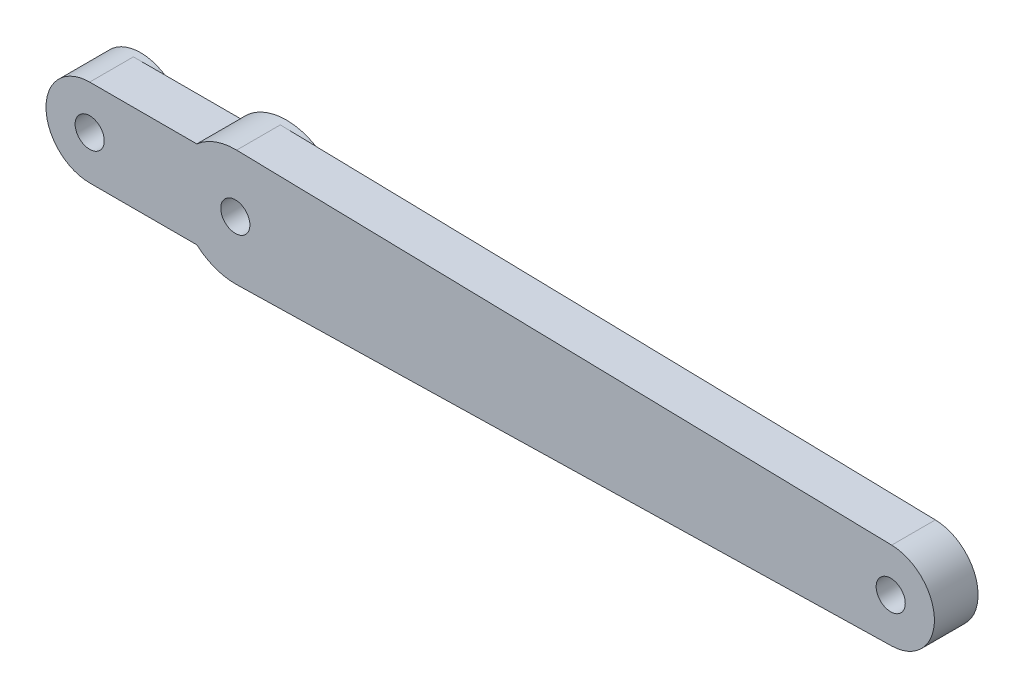
ISO-10303-21;
HEADER;
FILE_DESCRIPTION(('STEP AP214'),'2;1');
FILE_NAME('part.step','',(''),(''),'','','');
FILE_SCHEMA(('AUTOMOTIVE_DESIGN { 1 0 10303 214 1 1 1 1 }'));
ENDSEC;
DATA;
#1=APPLICATION_CONTEXT('core data for automotive mechanical design processes');
#2=APPLICATION_PROTOCOL_DEFINITION('international standard','automotive_design',2000,#1);
#3=PRODUCT_CONTEXT('',#1,'mechanical');
#4=PRODUCT('Part','Part','',(#3));
#5=PRODUCT_RELATED_PRODUCT_CATEGORY('part','',(#4));
#6=PRODUCT_DEFINITION_FORMATION('','',#4);
#7=PRODUCT_DEFINITION_CONTEXT('part definition',#1,'design');
#8=PRODUCT_DEFINITION('design','',#6,#7);
#9=PRODUCT_DEFINITION_SHAPE('','',#8);
#10=(LENGTH_UNIT() NAMED_UNIT(*) SI_UNIT(.MILLI.,.METRE.));
#11=(NAMED_UNIT(*) PLANE_ANGLE_UNIT() SI_UNIT($,.RADIAN.));
#12=(NAMED_UNIT(*) SI_UNIT($,.STERADIAN.) SOLID_ANGLE_UNIT());
#13=UNCERTAINTY_MEASURE_WITH_UNIT(LENGTH_MEASURE(1.E-05),#10,'distance_accuracy_value','');
#14=(GEOMETRIC_REPRESENTATION_CONTEXT(3) GLOBAL_UNCERTAINTY_ASSIGNED_CONTEXT((#13)) GLOBAL_UNIT_ASSIGNED_CONTEXT((#10,
#11,#12)) REPRESENTATION_CONTEXT('',''));
#15=CARTESIAN_POINT('',(0.,0.,0.));
#16=DIRECTION('',(0.,0.,1.));
#17=DIRECTION('',(1.,0.,0.));
#18=AXIS2_PLACEMENT_3D('',#15,#16,#17);
#19=CARTESIAN_POINT('',(0.,0.,0.));
#20=DIRECTION('',(0.,0.,1.));
#21=DIRECTION('',(1.,0.,0.));
#22=AXIS2_PLACEMENT_3D('',#19,#20,#21);
#23=PLANE('',#22);
#24=CARTESIAN_POINT('',(0.,0.,0.));
#25=DIRECTION('',(0.,0.,-1.));
#26=DIRECTION('',(-1.,0.,0.));
#27=AXIS2_PLACEMENT_3D('',#24,#25,#26);
#28=CIRCLE('',#27,4.);
#29=CARTESIAN_POINT('',(-2.64575131106459,-3.,0.));
#30=VERTEX_POINT('',#29);
#31=CARTESIAN_POINT('',(-2.64575131106459,3.,0.));
#32=VERTEX_POINT('',#31);
#33=EDGE_CURVE('E178',#30,#32,#28,.T.);
#34=ORIENTED_EDGE('',*,*,#33,.F.);
#35=DIRECTION('',(-1.,0.,0.));
#36=VECTOR('',#35,1.);
#37=CARTESIAN_POINT('',(0.,-3.,0.));
#38=LINE('',#37,#36);
#39=CARTESIAN_POINT('',(-10.,-3.,0.));
#40=VERTEX_POINT('',#39);
#41=EDGE_CURVE('E140',#30,#40,#38,.T.);
#42=ORIENTED_EDGE('',*,*,#41,.T.);
#43=CARTESIAN_POINT('',(-10.,0.,0.));
#44=DIRECTION('',(0.,0.,-1.));
#45=DIRECTION('',(-1.,0.,0.));
#46=AXIS2_PLACEMENT_3D('',#43,#44,#45);
#47=CIRCLE('',#46,3.);
#48=CARTESIAN_POINT('',(-10.,3.,0.));
#49=VERTEX_POINT('',#48);
#50=EDGE_CURVE('E169',#49,#40,#47,.T.);
#51=ORIENTED_EDGE('',*,*,#50,.F.);
#52=DIRECTION('',(-1.,0.,0.));
#53=VECTOR('',#52,1.);
#54=CARTESIAN_POINT('',(0.,3.,0.));
#55=LINE('',#54,#53);
#56=EDGE_CURVE('E137',#32,#49,#55,.T.);
#57=ORIENTED_EDGE('',*,*,#56,.F.);
#58=EDGE_LOOP('',(#34,#42,#51,#57));
#59=FACE_BOUND('',#58,.T.);
#60=ADVANCED_FACE('F39',(#59),#23,.F.);
#61=CARTESIAN_POINT('',(45.,0.,0.));
#62=DIRECTION('',(0.,0.,1.));
#63=DIRECTION('',(1.,0.,0.));
#64=AXIS2_PLACEMENT_3D('',#61,#62,#63);
#65=CIRCLE('',#64,0.999999999999998);
#66=CARTESIAN_POINT('',(46.,0.,0.));
#67=VERTEX_POINT('',#66);
#68=EDGE_CURVE('E150',#67,#67,#65,.T.);
#69=ORIENTED_EDGE('',*,*,#68,.T.);
#70=EDGE_LOOP('',(#69));
#71=FACE_BOUND('',#70,.T.);
#72=CARTESIAN_POINT('',(0.0888888888888888,3.99901222371626,0.));
#73=VERTEX_POINT('',#72);
#74=CARTESIAN_POINT('',(0.0888888888888888,-3.99901222371626,0.));
#75=VERTEX_POINT('',#74);
#76=EDGE_CURVE('E185',#73,#75,#28,.T.);
#77=ORIENTED_EDGE('',*,*,#76,.F.);
#78=DIRECTION('',(0.999753055929066,-0.0222222222222222,0.));
#79=VECTOR('',#78,1.);
#80=CARTESIAN_POINT('',(0.0888888888888888,3.99901222371626,0.));
#81=LINE('',#80,#79);
#82=CARTESIAN_POINT('',(45.0666666666667,2.9992591677872,0.));
#83=VERTEX_POINT('',#82);
#84=EDGE_CURVE('E147',#73,#83,#81,.T.);
#85=ORIENTED_EDGE('',*,*,#84,.T.);
#86=CARTESIAN_POINT('',(45.,0.,0.));
#87=DIRECTION('',(0.,0.,1.));
#88=DIRECTION('',(1.,0.,0.));
#89=AXIS2_PLACEMENT_3D('',#86,#87,#88);
#90=CIRCLE('',#89,3.);
#91=CARTESIAN_POINT('',(45.0666666666667,-2.9992591677872,0.));
#92=VERTEX_POINT('',#91);
#93=EDGE_CURVE('E145',#92,#83,#90,.T.);
#94=ORIENTED_EDGE('',*,*,#93,.F.);
#95=DIRECTION('',(0.999753055929066,0.0222222222222222,0.));
#96=VECTOR('',#95,1.);
#97=CARTESIAN_POINT('',(0.0888888888888889,-3.99901222371626,0.));
#98=LINE('',#97,#96);
#99=EDGE_CURVE('E75',#75,#92,#98,.T.);
#100=ORIENTED_EDGE('',*,*,#99,.F.);
#101=EDGE_LOOP('',(#77,#85,#94,#100));
#102=FACE_BOUND('',#101,.T.);
#103=ADVANCED_FACE('F186',(#71,#102),#23,.F.);
#104=CARTESIAN_POINT('',(0.,3.,3.));
#105=DIRECTION('',(0.,-1.,0.));
#106=DIRECTION('',(1.,0.,0.));
#107=AXIS2_PLACEMENT_3D('',#104,#105,#106);
#108=PLANE('',#107);
#109=ORIENTED_EDGE('',*,*,#56,.T.);
#110=DIRECTION('',(0.,0.,-1.));
#111=VECTOR('',#110,1.);
#112=CARTESIAN_POINT('',(-10.,3.,3.));
#113=LINE('',#112,#111);
#114=CARTESIAN_POINT('',(-10.,3.,3.));
#115=VERTEX_POINT('',#114);
#116=EDGE_CURVE('E48',#115,#49,#113,.T.);
#117=ORIENTED_EDGE('',*,*,#116,.F.);
#118=DIRECTION('',(-1.,0.,0.));
#119=VECTOR('',#118,1.);
#120=CARTESIAN_POINT('',(0.,3.,3.));
#121=LINE('',#120,#119);
#122=CARTESIAN_POINT('',(-2.64575131106459,3.,3.));
#123=VERTEX_POINT('',#122);
#124=EDGE_CURVE('E88',#123,#115,#121,.T.);
#125=ORIENTED_EDGE('',*,*,#124,.F.);
#126=DIRECTION('',(0.,0.,-1.));
#127=VECTOR('',#126,1.);
#128=CARTESIAN_POINT('',(-2.64575131106459,3.,3.));
#129=LINE('',#128,#127);
#130=EDGE_CURVE('E11',#123,#32,#129,.T.);
#131=ORIENTED_EDGE('',*,*,#130,.T.);
#132=EDGE_LOOP('',(#109,#117,#125,#131));
#133=FACE_BOUND('',#132,.T.);
#134=ADVANCED_FACE('F41',(#133),#108,.F.);
#135=CARTESIAN_POINT('',(-10.,0.,3.));
#136=DIRECTION('',(0.,0.,-1.));
#137=DIRECTION('',(-1.,0.,0.));
#138=AXIS2_PLACEMENT_3D('',#135,#136,#137);
#139=CYLINDRICAL_SURFACE('',#138,3.);
#140=ORIENTED_EDGE('',*,*,#116,.T.);
#141=ORIENTED_EDGE('',*,*,#50,.T.);
#142=DIRECTION('',(0.,0.,-1.));
#143=VECTOR('',#142,1.);
#144=CARTESIAN_POINT('',(-10.,-3.,3.));
#145=LINE('',#144,#143);
#146=CARTESIAN_POINT('',(-10.,-3.,3.));
#147=VERTEX_POINT('',#146);
#148=EDGE_CURVE('E160',#147,#40,#145,.T.);
#149=ORIENTED_EDGE('',*,*,#148,.F.);
#150=CARTESIAN_POINT('',(-10.,0.,3.));
#151=DIRECTION('',(0.,0.,1.));
#152=DIRECTION('',(1.,0.,0.));
#153=AXIS2_PLACEMENT_3D('',#150,#151,#152);
#154=CIRCLE('',#153,3.);
#155=EDGE_CURVE('E170',#115,#147,#154,.T.);
#156=ORIENTED_EDGE('',*,*,#155,.F.);
#157=EDGE_LOOP('',(#140,#141,#149,#156));
#158=FACE_BOUND('',#157,.T.);
#159=CARTESIAN_POINT('',(-10.,0.,-0.5));
#160=DIRECTION('',(0.,0.,-1.));
#161=DIRECTION('',(-1.,0.,0.));
#162=AXIS2_PLACEMENT_3D('',#159,#160,#161);
#163=CIRCLE('',#162,3.);
#164=CARTESIAN_POINT('',(-13.,0.,-0.5));
#165=VERTEX_POINT('',#164);
#166=EDGE_CURVE('E141',#165,#165,#163,.T.);
#167=ORIENTED_EDGE('',*,*,#166,.F.);
#168=EDGE_LOOP('',(#167));
#169=FACE_BOUND('',#168,.T.);
#170=ADVANCED_FACE('F165',(#158,#169),#139,.T.);
#171=CARTESIAN_POINT('',(0.,-3.,3.));
#172=DIRECTION('',(0.,-1.,0.));
#173=DIRECTION('',(1.,0.,0.));
#174=AXIS2_PLACEMENT_3D('',#171,#172,#173);
#175=PLANE('',#174);
#176=ORIENTED_EDGE('',*,*,#41,.F.);
#177=DIRECTION('',(0.,0.,-1.));
#178=VECTOR('',#177,1.);
#179=CARTESIAN_POINT('',(-2.64575131106459,-3.,3.));
#180=LINE('',#179,#178);
#181=CARTESIAN_POINT('',(-2.64575131106459,-3.,3.));
#182=VERTEX_POINT('',#181);
#183=EDGE_CURVE('E157',#182,#30,#180,.T.);
#184=ORIENTED_EDGE('',*,*,#183,.F.);
#185=DIRECTION('',(-1.,0.,0.));
#186=VECTOR('',#185,1.);
#187=CARTESIAN_POINT('',(0.,-3.,3.));
#188=LINE('',#187,#186);
#189=EDGE_CURVE('E237',#182,#147,#188,.T.);
#190=ORIENTED_EDGE('',*,*,#189,.T.);
#191=ORIENTED_EDGE('',*,*,#148,.T.);
#192=EDGE_LOOP('',(#176,#184,#190,#191));
#193=FACE_BOUND('',#192,.T.);
#194=ADVANCED_FACE('F241',(#193),#175,.T.);
#195=CARTESIAN_POINT('',(0.,0.,3.));
#196=DIRECTION('',(0.,0.,-1.));
#197=DIRECTION('',(-1.,0.,0.));
#198=AXIS2_PLACEMENT_3D('',#195,#196,#197);
#199=CYLINDRICAL_SURFACE('',#198,4.);
#200=ORIENTED_EDGE('',*,*,#183,.T.);
#201=ORIENTED_EDGE('',*,*,#33,.T.);
#202=ORIENTED_EDGE('',*,*,#130,.F.);
#203=CARTESIAN_POINT('',(0.,0.,3.));
#204=DIRECTION('',(0.,0.,1.));
#205=DIRECTION('',(1.,0.,0.));
#206=AXIS2_PLACEMENT_3D('',#203,#204,#205);
#207=CIRCLE('',#206,4.);
#208=CARTESIAN_POINT('',(0.0888888888888889,3.99901222371626,3.));
#209=VERTEX_POINT('',#208);
#210=EDGE_CURVE('E153',#209,#123,#207,.T.);
#211=ORIENTED_EDGE('',*,*,#210,.F.);
#212=DIRECTION('',(0.,0.,-1.));
#213=VECTOR('',#212,1.);
#214=CARTESIAN_POINT('',(0.0888888888888889,3.99901222371626,3.));
#215=LINE('',#214,#213);
#216=EDGE_CURVE('E56',#209,#73,#215,.T.);
#217=ORIENTED_EDGE('',*,*,#216,.T.);
#218=ORIENTED_EDGE('',*,*,#76,.T.);
#219=DIRECTION('',(0.,0.,-1.));
#220=VECTOR('',#219,1.);
#221=CARTESIAN_POINT('',(0.0888888888888888,-3.99901222371626,3.));
#222=LINE('',#221,#220);
#223=CARTESIAN_POINT('',(0.0888888888888888,-3.99901222371626,3.));
#224=VERTEX_POINT('',#223);
#225=EDGE_CURVE('E120',#224,#75,#222,.T.);
#226=ORIENTED_EDGE('',*,*,#225,.F.);
#227=EDGE_CURVE('E113',#182,#224,#207,.T.);
#228=ORIENTED_EDGE('',*,*,#227,.F.);
#229=EDGE_LOOP('',(#200,#201,#202,#211,#217,#218,#226,#228));
#230=FACE_BOUND('',#229,.T.);
#231=CARTESIAN_POINT('',(0.,0.,-0.5));
#232=DIRECTION('',(0.,0.,-1.));
#233=DIRECTION('',(-1.,0.,0.));
#234=AXIS2_PLACEMENT_3D('',#231,#232,#233);
#235=CIRCLE('',#234,4.);
#236=CARTESIAN_POINT('',(-4.,0.,-0.5));
#237=VERTEX_POINT('',#236);
#238=EDGE_CURVE('E230',#237,#237,#235,.T.);
#239=ORIENTED_EDGE('',*,*,#238,.F.);
#240=EDGE_LOOP('',(#239));
#241=FACE_BOUND('',#240,.T.);
#242=ADVANCED_FACE('F189',(#230,#241),#199,.T.);
#243=CARTESIAN_POINT('',(0.0888888888888889,-3.99901222371626,3.));
#244=DIRECTION('',(-0.0222222222222222,0.999753055929066,0.));
#245=DIRECTION('',(-0.999753055929066,-0.0222222222222222,0.));
#246=AXIS2_PLACEMENT_3D('',#243,#244,#245);
#247=PLANE('',#246);
#248=ORIENTED_EDGE('',*,*,#99,.T.);
#249=DIRECTION('',(0.,0.,-1.));
#250=VECTOR('',#249,1.);
#251=CARTESIAN_POINT('',(45.0666666666667,-2.9992591677872,3.));
#252=LINE('',#251,#250);
#253=CARTESIAN_POINT('',(45.0666666666667,-2.9992591677872,3.));
#254=VERTEX_POINT('',#253);
#255=EDGE_CURVE('E116',#254,#92,#252,.T.);
#256=ORIENTED_EDGE('',*,*,#255,.F.);
#257=DIRECTION('',(0.999753055929066,0.0222222222222222,0.));
#258=VECTOR('',#257,1.);
#259=CARTESIAN_POINT('',(0.0888888888888889,-3.99901222371626,3.));
#260=LINE('',#259,#258);
#261=EDGE_CURVE('E105',#224,#254,#260,.T.);
#262=ORIENTED_EDGE('',*,*,#261,.F.);
#263=ORIENTED_EDGE('',*,*,#225,.T.);
#264=EDGE_LOOP('',(#248,#256,#262,#263));
#265=FACE_BOUND('',#264,.T.);
#266=ADVANCED_FACE('F117',(#265),#247,.F.);
#267=CARTESIAN_POINT('',(45.,0.,3.));
#268=DIRECTION('',(0.,0.,-1.));
#269=DIRECTION('',(-1.,0.,0.));
#270=AXIS2_PLACEMENT_3D('',#267,#268,#269);
#271=CYLINDRICAL_SURFACE('',#270,3.);
#272=ORIENTED_EDGE('',*,*,#93,.T.);
#273=DIRECTION('',(0.,0.,-1.));
#274=VECTOR('',#273,1.);
#275=CARTESIAN_POINT('',(45.0666666666667,2.9992591677872,3.));
#276=LINE('',#275,#274);
#277=CARTESIAN_POINT('',(45.0666666666667,2.9992591677872,3.));
#278=VERTEX_POINT('',#277);
#279=EDGE_CURVE('E80',#278,#83,#276,.T.);
#280=ORIENTED_EDGE('',*,*,#279,.F.);
#281=CARTESIAN_POINT('',(45.,0.,3.));
#282=DIRECTION('',(0.,0.,1.));
#283=DIRECTION('',(1.,0.,0.));
#284=AXIS2_PLACEMENT_3D('',#281,#282,#283);
#285=CIRCLE('',#284,3.);
#286=EDGE_CURVE('E110',#254,#278,#285,.T.);
#287=ORIENTED_EDGE('',*,*,#286,.F.);
#288=ORIENTED_EDGE('',*,*,#255,.T.);
#289=EDGE_LOOP('',(#272,#280,#287,#288));
#290=FACE_BOUND('',#289,.T.);
#291=ADVANCED_FACE('F122',(#290),#271,.T.);
#292=CARTESIAN_POINT('',(0.,0.,3.));
#293=DIRECTION('',(0.,0.,-1.));
#294=DIRECTION('',(-1.,0.,0.));
#295=AXIS2_PLACEMENT_3D('',#292,#293,#294);
#296=CYLINDRICAL_SURFACE('',#295,1.);
#297=CARTESIAN_POINT('',(0.,0.,3.));
#298=DIRECTION('',(0.,0.,1.));
#299=DIRECTION('',(1.,0.,0.));
#300=AXIS2_PLACEMENT_3D('',#297,#298,#299);
#301=CIRCLE('',#300,1.);
#302=CARTESIAN_POINT('',(1.,0.,3.));
#303=VERTEX_POINT('',#302);
#304=EDGE_CURVE('E131',#303,#303,#301,.T.);
#305=ORIENTED_EDGE('',*,*,#304,.T.);
#306=EDGE_LOOP('',(#305));
#307=FACE_BOUND('',#306,.T.);
#308=CARTESIAN_POINT('',(0.,0.,-0.5));
#309=DIRECTION('',(0.,0.,-1.));
#310=DIRECTION('',(-1.,0.,0.));
#311=AXIS2_PLACEMENT_3D('',#308,#309,#310);
#312=CIRCLE('',#311,1.);
#313=CARTESIAN_POINT('',(-1.,0.,-0.5));
#314=VERTEX_POINT('',#313);
#315=EDGE_CURVE('E187',#314,#314,#312,.T.);
#316=ORIENTED_EDGE('',*,*,#315,.T.);
#317=EDGE_LOOP('',(#316));
#318=FACE_BOUND('',#317,.T.);
#319=ADVANCED_FACE('F202',(#307,#318),#296,.F.);
#320=CARTESIAN_POINT('',(45.,0.,3.));
#321=DIRECTION('',(0.,0.,-1.));
#322=DIRECTION('',(-1.,0.,0.));
#323=AXIS2_PLACEMENT_3D('',#320,#321,#322);
#324=CYLINDRICAL_SURFACE('',#323,0.999999999999998);
#325=CARTESIAN_POINT('',(45.,0.,3.));
#326=DIRECTION('',(0.,0.,1.));
#327=DIRECTION('',(1.,0.,0.));
#328=AXIS2_PLACEMENT_3D('',#325,#326,#327);
#329=CIRCLE('',#328,0.999999999999998);
#330=CARTESIAN_POINT('',(46.,0.,3.));
#331=VERTEX_POINT('',#330);
#332=EDGE_CURVE('E125',#331,#331,#329,.T.);
#333=ORIENTED_EDGE('',*,*,#332,.T.);
#334=EDGE_LOOP('',(#333));
#335=FACE_BOUND('',#334,.T.);
#336=ORIENTED_EDGE('',*,*,#68,.F.);
#337=EDGE_LOOP('',(#336));
#338=FACE_BOUND('',#337,.T.);
#339=ADVANCED_FACE('F194',(#335,#338),#324,.F.);
#340=CARTESIAN_POINT('',(0.0888888888888888,3.99901222371626,3.));
#341=DIRECTION('',(0.0222222222222222,0.999753055929066,0.));
#342=DIRECTION('',(-0.999753055929066,0.0222222222222222,0.));
#343=AXIS2_PLACEMENT_3D('',#340,#341,#342);
#344=PLANE('',#343);
#345=ORIENTED_EDGE('',*,*,#84,.F.);
#346=ORIENTED_EDGE('',*,*,#216,.F.);
#347=DIRECTION('',(0.999753055929066,-0.0222222222222222,0.));
#348=VECTOR('',#347,1.);
#349=CARTESIAN_POINT('',(0.0888888888888888,3.99901222371626,3.));
#350=LINE('',#349,#348);
#351=EDGE_CURVE('E123',#209,#278,#350,.T.);
#352=ORIENTED_EDGE('',*,*,#351,.T.);
#353=ORIENTED_EDGE('',*,*,#279,.T.);
#354=EDGE_LOOP('',(#345,#346,#352,#353));
#355=FACE_BOUND('',#354,.T.);
#356=ADVANCED_FACE('F191',(#355),#344,.T.);
#357=CARTESIAN_POINT('',(-10.,0.,3.));
#358=DIRECTION('',(0.,0.,-1.));
#359=DIRECTION('',(-1.,0.,0.));
#360=AXIS2_PLACEMENT_3D('',#357,#358,#359);
#361=CYLINDRICAL_SURFACE('',#360,1.);
#362=CARTESIAN_POINT('',(-10.,0.,3.));
#363=DIRECTION('',(0.,0.,1.));
#364=DIRECTION('',(1.,0.,0.));
#365=AXIS2_PLACEMENT_3D('',#362,#363,#364);
#366=CIRCLE('',#365,1.);
#367=CARTESIAN_POINT('',(-9.,0.,3.));
#368=VERTEX_POINT('',#367);
#369=EDGE_CURVE('E134',#368,#368,#366,.T.);
#370=ORIENTED_EDGE('',*,*,#369,.T.);
#371=EDGE_LOOP('',(#370));
#372=FACE_BOUND('',#371,.T.);
#373=CARTESIAN_POINT('',(-10.,0.,-0.5));
#374=DIRECTION('',(0.,0.,-1.));
#375=DIRECTION('',(-1.,0.,0.));
#376=AXIS2_PLACEMENT_3D('',#373,#374,#375);
#377=CIRCLE('',#376,1.);
#378=CARTESIAN_POINT('',(-11.,0.,-0.5));
#379=VERTEX_POINT('',#378);
#380=EDGE_CURVE('E225',#379,#379,#377,.T.);
#381=ORIENTED_EDGE('',*,*,#380,.T.);
#382=EDGE_LOOP('',(#381));
#383=FACE_BOUND('',#382,.T.);
#384=ADVANCED_FACE('F193',(#372,#383),#361,.F.);
#385=CARTESIAN_POINT('',(0.,0.,3.));
#386=DIRECTION('',(0.,0.,1.));
#387=DIRECTION('',(1.,0.,0.));
#388=AXIS2_PLACEMENT_3D('',#385,#386,#387);
#389=PLANE('',#388);
#390=ORIENTED_EDGE('',*,*,#210,.T.);
#391=ORIENTED_EDGE('',*,*,#124,.T.);
#392=ORIENTED_EDGE('',*,*,#155,.T.);
#393=ORIENTED_EDGE('',*,*,#189,.F.);
#394=ORIENTED_EDGE('',*,*,#227,.T.);
#395=ORIENTED_EDGE('',*,*,#261,.T.);
#396=ORIENTED_EDGE('',*,*,#286,.T.);
#397=ORIENTED_EDGE('',*,*,#351,.F.);
#398=EDGE_LOOP('',(#390,#391,#392,#393,#394,#395,#396,#397));
#399=FACE_BOUND('',#398,.T.);
#400=ORIENTED_EDGE('',*,*,#332,.F.);
#401=EDGE_LOOP('',(#400));
#402=FACE_BOUND('',#401,.T.);
#403=ORIENTED_EDGE('',*,*,#304,.F.);
#404=EDGE_LOOP('',(#403));
#405=FACE_BOUND('',#404,.T.);
#406=ORIENTED_EDGE('',*,*,#369,.F.);
#407=EDGE_LOOP('',(#406));
#408=FACE_BOUND('',#407,.T.);
#409=ADVANCED_FACE('F106',(#399,#402,#405,#408),#389,.T.);
#410=CARTESIAN_POINT('',(-10.,0.,-0.5));
#411=DIRECTION('',(0.,0.,-1.));
#412=DIRECTION('',(-1.,0.,0.));
#413=AXIS2_PLACEMENT_3D('',#410,#411,#412);
#414=PLANE('',#413);
#415=ORIENTED_EDGE('',*,*,#166,.T.);
#416=EDGE_LOOP('',(#415));
#417=FACE_BOUND('',#416,.T.);
#418=ORIENTED_EDGE('',*,*,#380,.F.);
#419=EDGE_LOOP('',(#418));
#420=FACE_BOUND('',#419,.T.);
#421=ADVANCED_FACE('F277',(#417,#420),#414,.T.);
#422=CARTESIAN_POINT('',(0.,0.,-0.5));
#423=DIRECTION('',(0.,0.,-1.));
#424=DIRECTION('',(-1.,0.,0.));
#425=AXIS2_PLACEMENT_3D('',#422,#423,#424);
#426=PLANE('',#425);
#427=ORIENTED_EDGE('',*,*,#238,.T.);
#428=EDGE_LOOP('',(#427));
#429=FACE_BOUND('',#428,.T.);
#430=ORIENTED_EDGE('',*,*,#315,.F.);
#431=EDGE_LOOP('',(#430));
#432=FACE_BOUND('',#431,.T.);
#433=ADVANCED_FACE('F348',(#429,#432),#426,.T.);
#434=CLOSED_SHELL('',(#60,#103,#134,#170,#194,#242,#266,#291,#319,#339,#356,#384,#409,#421,#433));
#435=MANIFOLD_SOLID_BREP('B2',#434);
#436=ADVANCED_BREP_SHAPE_REPRESENTATION('',(#18,#435),#14);
#437=SHAPE_DEFINITION_REPRESENTATION(#9,#436);
ENDSEC;
END-ISO-10303-21;
